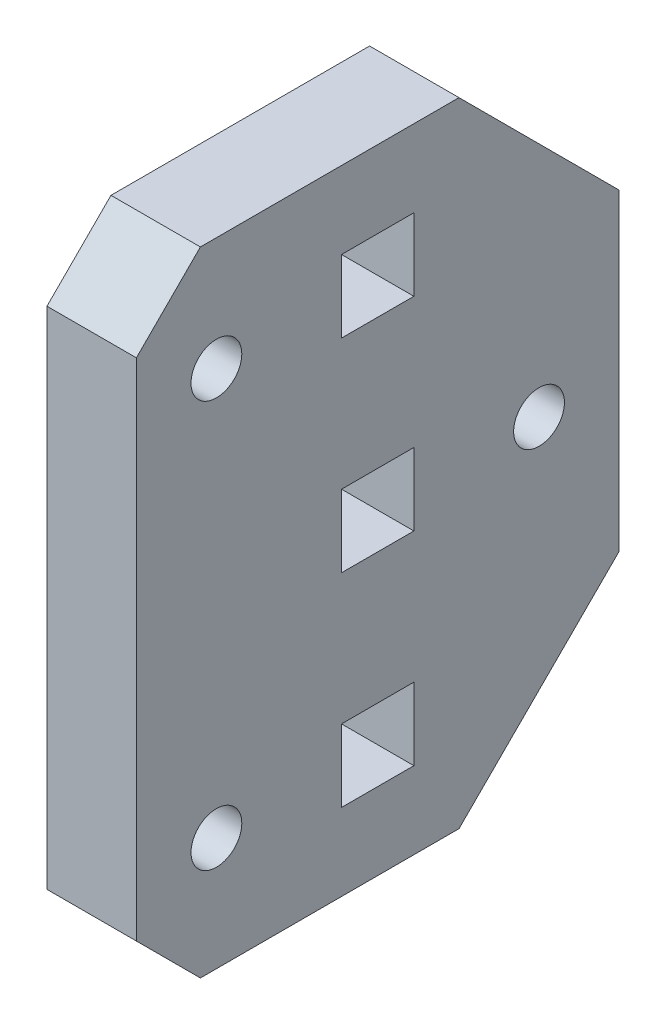
ISO-10303-21;
HEADER;
FILE_DESCRIPTION(('STEP AP214'),'2;1');
FILE_NAME('part.step','',(''),(''),'','','');
FILE_SCHEMA(('AUTOMOTIVE_DESIGN { 1 0 10303 214 1 1 1 1 }'));
ENDSEC;
DATA;
#1=APPLICATION_CONTEXT('core data for automotive mechanical design processes');
#2=APPLICATION_PROTOCOL_DEFINITION('international standard','automotive_design',2000,#1);
#3=PRODUCT_CONTEXT('',#1,'mechanical');
#4=PRODUCT('Part','Part','',(#3));
#5=PRODUCT_RELATED_PRODUCT_CATEGORY('part','',(#4));
#6=PRODUCT_DEFINITION_FORMATION('','',#4);
#7=PRODUCT_DEFINITION_CONTEXT('part definition',#1,'design');
#8=PRODUCT_DEFINITION('design','',#6,#7);
#9=PRODUCT_DEFINITION_SHAPE('','',#8);
#10=(LENGTH_UNIT() NAMED_UNIT(*) SI_UNIT(.MILLI.,.METRE.));
#11=(NAMED_UNIT(*) PLANE_ANGLE_UNIT() SI_UNIT($,.RADIAN.));
#12=(NAMED_UNIT(*) SI_UNIT($,.STERADIAN.) SOLID_ANGLE_UNIT());
#13=UNCERTAINTY_MEASURE_WITH_UNIT(LENGTH_MEASURE(1.E-05),#10,'distance_accuracy_value','');
#14=(GEOMETRIC_REPRESENTATION_CONTEXT(3) GLOBAL_UNCERTAINTY_ASSIGNED_CONTEXT((#13)) GLOBAL_UNIT_ASSIGNED_CONTEXT((#10,
#11,#12)) REPRESENTATION_CONTEXT('',''));
#15=CARTESIAN_POINT('',(0.,0.,0.));
#16=DIRECTION('',(0.,0.,1.));
#17=DIRECTION('',(1.,0.,0.));
#18=AXIS2_PLACEMENT_3D('',#15,#16,#17);
#19=CARTESIAN_POINT('',(5.588,0.,0.));
#20=DIRECTION('',(1.,0.,0.));
#21=DIRECTION('',(0.,0.,-1.));
#22=AXIS2_PLACEMENT_3D('',#19,#20,#21);
#23=PLANE('',#22);
#24=CARTESIAN_POINT('',(5.588,-12.6999951137207,10.0799951137272));
#25=DIRECTION('',(1.,0.,0.));
#26=DIRECTION('',(0.,0.,-1.));
#27=AXIS2_PLACEMENT_3D('',#24,#25,#26);
#28=CIRCLE('',#27,1.5875);
#29=CARTESIAN_POINT('',(5.588,-12.6999951137207,8.49249511372718));
#30=VERTEX_POINT('',#29);
#31=EDGE_CURVE('E593',#30,#30,#28,.T.);
#32=ORIENTED_EDGE('',*,*,#31,.F.);
#33=EDGE_LOOP('',(#32));
#34=FACE_BOUND('',#33,.T.);
#35=DIRECTION('',(0.,0.,-1.));
#36=VECTOR('',#35,1.);
#37=CARTESIAN_POINT('',(5.588,-14.9605902274463,2.26059022745141));
#38=LINE('',#37,#36);
#39=CARTESIAN_POINT('',(5.588,-14.9605902274463,2.26059022745141));
#40=VERTEX_POINT('',#39);
#41=CARTESIAN_POINT('',(5.588,-14.9605902274463,-2.26059999999982));
#42=VERTEX_POINT('',#41);
#43=EDGE_CURVE('E185',#40,#42,#38,.T.);
#44=ORIENTED_EDGE('',*,*,#43,.F.);
#45=DIRECTION('',(0.,-1.,0.));
#46=VECTOR('',#45,1.);
#47=CARTESIAN_POINT('',(5.588,-10.4393999999951,2.26059022745141));
#48=LINE('',#47,#46);
#49=CARTESIAN_POINT('',(5.588,-10.4393999999951,2.26059022745141));
#50=VERTEX_POINT('',#49);
#51=EDGE_CURVE('E175',#50,#40,#48,.T.);
#52=ORIENTED_EDGE('',*,*,#51,.F.);
#53=DIRECTION('',(0.,0.,1.));
#54=VECTOR('',#53,1.);
#55=CARTESIAN_POINT('',(5.588,-10.4393999999951,2.26059022745141));
#56=LINE('',#55,#54);
#57=CARTESIAN_POINT('',(5.588,-10.4393999999951,-2.26059999999982));
#58=VERTEX_POINT('',#57);
#59=EDGE_CURVE('E201',#58,#50,#56,.T.);
#60=ORIENTED_EDGE('',*,*,#59,.F.);
#61=DIRECTION('',(0.,1.,0.));
#62=VECTOR('',#61,1.);
#63=CARTESIAN_POINT('',(5.588,-10.4393999999951,-2.26059999999982));
#64=LINE('',#63,#62);
#65=EDGE_CURVE('E199',#42,#58,#64,.T.);
#66=ORIENTED_EDGE('',*,*,#65,.F.);
#67=EDGE_LOOP('',(#44,#52,#60,#66));
#68=FACE_BOUND('',#67,.T.);
#69=DIRECTION('',(0.,0.,-1.));
#70=VECTOR('',#69,1.);
#71=CARTESIAN_POINT('',(5.588,-2.26059511372562,2.26059511372562));
#72=LINE('',#71,#70);
#73=CARTESIAN_POINT('',(5.588,-2.26059511372562,2.26059511372562));
#74=VERTEX_POINT('',#73);
#75=CARTESIAN_POINT('',(5.588,-2.26059511372562,-2.26059511372562));
#76=VERTEX_POINT('',#75);
#77=EDGE_CURVE('E221',#74,#76,#72,.T.);
#78=ORIENTED_EDGE('',*,*,#77,.F.);
#79=DIRECTION('',(0.,-1.,0.));
#80=VECTOR('',#79,1.);
#81=CARTESIAN_POINT('',(5.588,2.26059511372562,2.26059511372562));
#82=LINE('',#81,#80);
#83=CARTESIAN_POINT('',(5.588,2.26059511372562,2.26059511372562));
#84=VERTEX_POINT('',#83);
#85=EDGE_CURVE('E219',#84,#74,#82,.T.);
#86=ORIENTED_EDGE('',*,*,#85,.F.);
#87=DIRECTION('',(0.,0.,1.));
#88=VECTOR('',#87,1.);
#89=CARTESIAN_POINT('',(5.588,2.26059511372562,2.26059511372562));
#90=LINE('',#89,#88);
#91=CARTESIAN_POINT('',(5.588,2.26059511372562,-2.26059511372562));
#92=VERTEX_POINT('',#91);
#93=EDGE_CURVE('E227',#92,#84,#90,.T.);
#94=ORIENTED_EDGE('',*,*,#93,.F.);
#95=DIRECTION('',(0.,1.,0.));
#96=VECTOR('',#95,1.);
#97=CARTESIAN_POINT('',(5.588,2.26059511372562,-2.26059511372562));
#98=LINE('',#97,#96);
#99=EDGE_CURVE('E224',#76,#92,#98,.T.);
#100=ORIENTED_EDGE('',*,*,#99,.F.);
#101=EDGE_LOOP('',(#78,#86,#94,#100));
#102=FACE_BOUND('',#101,.T.);
#103=DIRECTION('',(0.,0.,-1.));
#104=VECTOR('',#103,1.);
#105=CARTESIAN_POINT('',(5.588,10.4394097725486,2.26059022745141));
#106=LINE('',#105,#104);
#107=CARTESIAN_POINT('',(5.588,10.4394097725486,2.26059022745141));
#108=VERTEX_POINT('',#107);
#109=CARTESIAN_POINT('',(5.588,10.4394097725486,-2.26059999999982));
#110=VERTEX_POINT('',#109);
#111=EDGE_CURVE('E252',#108,#110,#106,.T.);
#112=ORIENTED_EDGE('',*,*,#111,.F.);
#113=DIRECTION('',(0.,-1.,0.));
#114=VECTOR('',#113,1.);
#115=CARTESIAN_POINT('',(5.588,14.9605999999998,2.26059022745142));
#116=LINE('',#115,#114);
#117=CARTESIAN_POINT('',(5.588,14.9605999999998,2.26059022745142));
#118=VERTEX_POINT('',#117);
#119=EDGE_CURVE('E250',#118,#108,#116,.T.);
#120=ORIENTED_EDGE('',*,*,#119,.F.);
#121=DIRECTION('',(0.,0.,1.));
#122=VECTOR('',#121,1.);
#123=CARTESIAN_POINT('',(5.588,14.9605999999998,2.26059022745142));
#124=LINE('',#123,#122);
#125=CARTESIAN_POINT('',(5.588,14.9605999999998,-2.26059999999982));
#126=VERTEX_POINT('',#125);
#127=EDGE_CURVE('E258',#126,#118,#124,.T.);
#128=ORIENTED_EDGE('',*,*,#127,.F.);
#129=DIRECTION('',(0.,1.,0.));
#130=VECTOR('',#129,1.);
#131=CARTESIAN_POINT('',(5.588,14.9605999999998,-2.26059999999982));
#132=LINE('',#131,#130);
#133=EDGE_CURVE('E255',#110,#126,#132,.T.);
#134=ORIENTED_EDGE('',*,*,#133,.F.);
#135=EDGE_LOOP('',(#112,#120,#128,#134));
#136=FACE_BOUND('',#135,.T.);
#137=DIRECTION('',(0.,-1.,0.));
#138=VECTOR('',#137,1.);
#139=CARTESIAN_POINT('',(5.588,19.7800048862752,15.0799951137272));
#140=LINE('',#139,#138);
#141=CARTESIAN_POINT('',(5.588,15.7800048862752,15.0799951137272));
#142=VERTEX_POINT('',#141);
#143=CARTESIAN_POINT('',(5.588,-15.779995113722,15.0799951137272));
#144=VERTEX_POINT('',#143);
#145=EDGE_CURVE('E281',#142,#144,#140,.T.);
#146=ORIENTED_EDGE('',*,*,#145,.T.);
#147=DIRECTION('',(0.,0.707106781186549,0.707106781186546));
#148=VECTOR('',#147,1.);
#149=CARTESIAN_POINT('',(5.588,-15.4299951137246,15.4299951137246));
#150=LINE('',#149,#148);
#151=CARTESIAN_POINT('',(5.588,-19.7799951137221,11.0799951137272));
#152=VERTEX_POINT('',#151);
#153=EDGE_CURVE('E43',#144,#152,#150,.F.);
#154=ORIENTED_EDGE('',*,*,#153,.T.);
#155=DIRECTION('',(0.,0.,-1.));
#156=VECTOR('',#155,1.);
#157=CARTESIAN_POINT('',(5.588,-19.7799951137221,15.0799951137272));
#158=LINE('',#157,#156);
#159=CARTESIAN_POINT('',(5.588,-19.7799951137221,-5.08000488627242));
#160=VERTEX_POINT('',#159);
#161=EDGE_CURVE('E283',#152,#160,#158,.T.);
#162=ORIENTED_EDGE('',*,*,#161,.T.);
#163=DIRECTION('',(0.,-0.707106781186546,0.707106781186549));
#164=VECTOR('',#163,1.);
#165=CARTESIAN_POINT('',(5.588,-12.4299999999973,-12.4299999999972));
#166=LINE('',#165,#164);
#167=CARTESIAN_POINT('',(5.588,-9.77999511372206,-15.0800048862724));
#168=VERTEX_POINT('',#167);
#169=EDGE_CURVE('E313',#160,#168,#166,.F.);
#170=ORIENTED_EDGE('',*,*,#169,.T.);
#171=DIRECTION('',(0.,1.,0.));
#172=VECTOR('',#171,1.);
#173=CARTESIAN_POINT('',(5.588,19.7800048862752,-15.0800048862724));
#174=LINE('',#173,#172);
#175=CARTESIAN_POINT('',(5.588,9.78000488627515,-15.0800048862724));
#176=VERTEX_POINT('',#175);
#177=EDGE_CURVE('E286',#168,#176,#174,.T.);
#178=ORIENTED_EDGE('',*,*,#177,.T.);
#179=DIRECTION('',(0.,-0.707106781186549,-0.707106781186546));
#180=VECTOR('',#179,1.);
#181=CARTESIAN_POINT('',(5.588,12.4300048862738,-12.4300048862738));
#182=LINE('',#181,#180);
#183=CARTESIAN_POINT('',(5.588,19.7800048862752,-5.08000488627243));
#184=VERTEX_POINT('',#183);
#185=EDGE_CURVE('E311',#176,#184,#182,.F.);
#186=ORIENTED_EDGE('',*,*,#185,.T.);
#187=DIRECTION('',(0.,0.,1.));
#188=VECTOR('',#187,1.);
#189=CARTESIAN_POINT('',(5.588,19.7800048862752,15.0799951137272));
#190=LINE('',#189,#188);
#191=CARTESIAN_POINT('',(5.588,19.7800048862752,11.0799951137272));
#192=VERTEX_POINT('',#191);
#193=EDGE_CURVE('E289',#184,#192,#190,.T.);
#194=ORIENTED_EDGE('',*,*,#193,.T.);
#195=DIRECTION('',(0.,0.707106781186547,-0.707106781186548));
#196=VECTOR('',#195,1.);
#197=CARTESIAN_POINT('',(5.588,15.4300000000012,15.4300000000012));
#198=LINE('',#197,#196);
#199=EDGE_CURVE('E329',#192,#142,#198,.F.);
#200=ORIENTED_EDGE('',*,*,#199,.T.);
#201=EDGE_LOOP('',(#146,#154,#162,#170,#178,#186,#194,#200));
#202=FACE_BOUND('',#201,.T.);
#203=CARTESIAN_POINT('',(5.588,12.7000048862742,10.0799951137272));
#204=DIRECTION('',(1.,0.,0.));
#205=DIRECTION('',(0.,0.,-1.));
#206=AXIS2_PLACEMENT_3D('',#203,#204,#205);
#207=CIRCLE('',#206,1.5875);
#208=CARTESIAN_POINT('',(5.588,12.7000048862742,8.49249511372718));
#209=VERTEX_POINT('',#208);
#210=EDGE_CURVE('E208',#209,#209,#207,.T.);
#211=ORIENTED_EDGE('',*,*,#210,.F.);
#212=EDGE_LOOP('',(#211));
#213=FACE_BOUND('',#212,.T.);
#214=CARTESIAN_POINT('',(5.588,0.,-10.0800048862724));
#215=DIRECTION('',(1.,0.,0.));
#216=DIRECTION('',(0.,0.,-1.));
#217=AXIS2_PLACEMENT_3D('',#214,#215,#216);
#218=CIRCLE('',#217,1.5875);
#219=CARTESIAN_POINT('',(5.588,0.,-11.6675048862724));
#220=VERTEX_POINT('',#219);
#221=EDGE_CURVE('E598',#220,#220,#218,.T.);
#222=ORIENTED_EDGE('',*,*,#221,.F.);
#223=EDGE_LOOP('',(#222));
#224=FACE_BOUND('',#223,.T.);
#225=ADVANCED_FACE('F35',(#34,#68,#102,#136,#202,#213,#224),#23,.T.);
#226=CARTESIAN_POINT('',(0.,0.,0.));
#227=DIRECTION('',(1.,0.,0.));
#228=DIRECTION('',(0.,0.,-1.));
#229=AXIS2_PLACEMENT_3D('',#226,#227,#228);
#230=PLANE('',#229);
#231=DIRECTION('',(0.,-1.,0.));
#232=VECTOR('',#231,1.);
#233=CARTESIAN_POINT('',(0.,2.26059511372562,2.26059511372562));
#234=LINE('',#233,#232);
#235=CARTESIAN_POINT('',(0.,2.26059511372562,2.26059511372562));
#236=VERTEX_POINT('',#235);
#237=CARTESIAN_POINT('',(0.,-2.26059511372562,2.26059511372562));
#238=VERTEX_POINT('',#237);
#239=EDGE_CURVE('E193',#236,#238,#234,.T.);
#240=ORIENTED_EDGE('',*,*,#239,.T.);
#241=DIRECTION('',(0.,0.,-1.));
#242=VECTOR('',#241,1.);
#243=CARTESIAN_POINT('',(0.,-2.26059511372562,2.26059511372562));
#244=LINE('',#243,#242);
#245=CARTESIAN_POINT('',(0.,-2.26059511372562,-2.26059511372562));
#246=VERTEX_POINT('',#245);
#247=EDGE_CURVE('E232',#238,#246,#244,.T.);
#248=ORIENTED_EDGE('',*,*,#247,.T.);
#249=DIRECTION('',(0.,1.,0.));
#250=VECTOR('',#249,1.);
#251=CARTESIAN_POINT('',(0.,2.26059511372562,-2.26059511372562));
#252=LINE('',#251,#250);
#253=CARTESIAN_POINT('',(0.,2.26059511372562,-2.26059511372562));
#254=VERTEX_POINT('',#253);
#255=EDGE_CURVE('E235',#246,#254,#252,.T.);
#256=ORIENTED_EDGE('',*,*,#255,.T.);
#257=DIRECTION('',(0.,0.,1.));
#258=VECTOR('',#257,1.);
#259=CARTESIAN_POINT('',(0.,2.26059511372562,2.26059511372562));
#260=LINE('',#259,#258);
#261=EDGE_CURVE('E222',#254,#236,#260,.T.);
#262=ORIENTED_EDGE('',*,*,#261,.T.);
#263=EDGE_LOOP('',(#240,#248,#256,#262));
#264=FACE_BOUND('',#263,.T.);
#265=DIRECTION('',(0.,0.,-1.));
#266=VECTOR('',#265,1.);
#267=CARTESIAN_POINT('',(0.,-19.7799951137221,15.0799951137272));
#268=LINE('',#267,#266);
#269=CARTESIAN_POINT('',(0.,-19.7799951137221,11.0799951137272));
#270=VERTEX_POINT('',#269);
#271=CARTESIAN_POINT('',(0.,-19.7799951137221,-5.08000488627242));
#272=VERTEX_POINT('',#271);
#273=EDGE_CURVE('E293',#270,#272,#268,.T.);
#274=ORIENTED_EDGE('',*,*,#273,.F.);
#275=DIRECTION('',(0.,-0.707106781186549,-0.707106781186546));
#276=VECTOR('',#275,1.);
#277=CARTESIAN_POINT('',(0.,-19.7799951137221,11.0799951137272));
#278=LINE('',#277,#276);
#279=CARTESIAN_POINT('',(0.,-15.779995113722,15.0799951137272));
#280=VERTEX_POINT('',#279);
#281=EDGE_CURVE('E323',#270,#280,#278,.F.);
#282=ORIENTED_EDGE('',*,*,#281,.T.);
#283=DIRECTION('',(0.,-1.,0.));
#284=VECTOR('',#283,1.);
#285=CARTESIAN_POINT('',(0.,19.7800048862752,15.0799951137272));
#286=LINE('',#285,#284);
#287=CARTESIAN_POINT('',(0.,15.7800048862752,15.0799951137272));
#288=VERTEX_POINT('',#287);
#289=EDGE_CURVE('E280',#288,#280,#286,.T.);
#290=ORIENTED_EDGE('',*,*,#289,.F.);
#291=DIRECTION('',(0.,-0.707106781186547,0.707106781186548));
#292=VECTOR('',#291,1.);
#293=CARTESIAN_POINT('',(0.,15.7800048862752,15.0799951137272));
#294=LINE('',#293,#292);
#295=CARTESIAN_POINT('',(0.,19.7800048862752,11.0799951137272));
#296=VERTEX_POINT('',#295);
#297=EDGE_CURVE('E321',#288,#296,#294,.F.);
#298=ORIENTED_EDGE('',*,*,#297,.T.);
#299=DIRECTION('',(0.,0.,1.));
#300=VECTOR('',#299,1.);
#301=CARTESIAN_POINT('',(0.,19.7800048862752,15.0799951137272));
#302=LINE('',#301,#300);
#303=CARTESIAN_POINT('',(0.,19.7800048862752,-5.08000488627243));
#304=VERTEX_POINT('',#303);
#305=EDGE_CURVE('E284',#304,#296,#302,.T.);
#306=ORIENTED_EDGE('',*,*,#305,.F.);
#307=DIRECTION('',(0.,0.707106781186549,0.707106781186546));
#308=VECTOR('',#307,1.);
#309=CARTESIAN_POINT('',(0.,19.7800048862752,-5.08000488627243));
#310=LINE('',#309,#308);
#311=CARTESIAN_POINT('',(0.,9.78000488627515,-15.0800048862724));
#312=VERTEX_POINT('',#311);
#313=EDGE_CURVE('E303',#304,#312,#310,.F.);
#314=ORIENTED_EDGE('',*,*,#313,.T.);
#315=DIRECTION('',(0.,1.,0.));
#316=VECTOR('',#315,1.);
#317=CARTESIAN_POINT('',(0.,19.7800048862752,-15.0800048862724));
#318=LINE('',#317,#316);
#319=CARTESIAN_POINT('',(0.,-9.77999511372206,-15.0800048862724));
#320=VERTEX_POINT('',#319);
#321=EDGE_CURVE('E295',#320,#312,#318,.T.);
#322=ORIENTED_EDGE('',*,*,#321,.F.);
#323=DIRECTION('',(0.,0.707106781186546,-0.707106781186549));
#324=VECTOR('',#323,1.);
#325=CARTESIAN_POINT('',(0.,-9.77999511372206,-15.0800048862724));
#326=LINE('',#325,#324);
#327=EDGE_CURVE('E305',#320,#272,#326,.F.);
#328=ORIENTED_EDGE('',*,*,#327,.T.);
#329=EDGE_LOOP('',(#274,#282,#290,#298,#306,#314,#322,#328));
#330=FACE_BOUND('',#329,.T.);
#331=DIRECTION('',(0.,-1.,0.));
#332=VECTOR('',#331,1.);
#333=CARTESIAN_POINT('',(0.,14.9605999999998,2.26059022745142));
#334=LINE('',#333,#332);
#335=CARTESIAN_POINT('',(0.,14.9605999999998,2.26059022745142));
#336=VERTEX_POINT('',#335);
#337=CARTESIAN_POINT('',(0.,10.4394097725486,2.26059022745141));
#338=VERTEX_POINT('',#337);
#339=EDGE_CURVE('E249',#336,#338,#334,.T.);
#340=ORIENTED_EDGE('',*,*,#339,.T.);
#341=DIRECTION('',(0.,0.,-1.));
#342=VECTOR('',#341,1.);
#343=CARTESIAN_POINT('',(0.,10.4394097725486,2.26059022745141));
#344=LINE('',#343,#342);
#345=CARTESIAN_POINT('',(0.,10.4394097725486,-2.26059999999982));
#346=VERTEX_POINT('',#345);
#347=EDGE_CURVE('E263',#338,#346,#344,.T.);
#348=ORIENTED_EDGE('',*,*,#347,.T.);
#349=DIRECTION('',(0.,1.,0.));
#350=VECTOR('',#349,1.);
#351=CARTESIAN_POINT('',(0.,14.9605999999998,-2.26059999999982));
#352=LINE('',#351,#350);
#353=CARTESIAN_POINT('',(0.,14.9605999999998,-2.26059999999982));
#354=VERTEX_POINT('',#353);
#355=EDGE_CURVE('E266',#346,#354,#352,.T.);
#356=ORIENTED_EDGE('',*,*,#355,.T.);
#357=DIRECTION('',(0.,0.,1.));
#358=VECTOR('',#357,1.);
#359=CARTESIAN_POINT('',(0.,14.9605999999998,2.26059022745142));
#360=LINE('',#359,#358);
#361=EDGE_CURVE('E253',#354,#336,#360,.T.);
#362=ORIENTED_EDGE('',*,*,#361,.T.);
#363=EDGE_LOOP('',(#340,#348,#356,#362));
#364=FACE_BOUND('',#363,.T.);
#365=DIRECTION('',(0.,-1.,0.));
#366=VECTOR('',#365,1.);
#367=CARTESIAN_POINT('',(0.,-10.4393999999951,2.26059022745141));
#368=LINE('',#367,#366);
#369=CARTESIAN_POINT('',(0.,-10.4393999999951,2.26059022745141));
#370=VERTEX_POINT('',#369);
#371=CARTESIAN_POINT('',(0.,-14.9605902274463,2.26059022745141));
#372=VERTEX_POINT('',#371);
#373=EDGE_CURVE('E206',#370,#372,#368,.T.);
#374=ORIENTED_EDGE('',*,*,#373,.T.);
#375=DIRECTION('',(0.,0.,-1.));
#376=VECTOR('',#375,1.);
#377=CARTESIAN_POINT('',(0.,-14.9605902274463,2.26059022745141));
#378=LINE('',#377,#376);
#379=CARTESIAN_POINT('',(0.,-14.9605902274463,-2.26059999999982));
#380=VERTEX_POINT('',#379);
#381=EDGE_CURVE('E192',#372,#380,#378,.T.);
#382=ORIENTED_EDGE('',*,*,#381,.T.);
#383=DIRECTION('',(0.,1.,0.));
#384=VECTOR('',#383,1.);
#385=CARTESIAN_POINT('',(0.,-10.4393999999951,-2.26059999999982));
#386=LINE('',#385,#384);
#387=CARTESIAN_POINT('',(0.,-10.4393999999951,-2.26059999999982));
#388=VERTEX_POINT('',#387);
#389=EDGE_CURVE('E210',#380,#388,#386,.T.);
#390=ORIENTED_EDGE('',*,*,#389,.T.);
#391=DIRECTION('',(0.,0.,1.));
#392=VECTOR('',#391,1.);
#393=CARTESIAN_POINT('',(0.,-10.4393999999951,2.26059022745141));
#394=LINE('',#393,#392);
#395=EDGE_CURVE('E186',#388,#370,#394,.T.);
#396=ORIENTED_EDGE('',*,*,#395,.T.);
#397=EDGE_LOOP('',(#374,#382,#390,#396));
#398=FACE_BOUND('',#397,.T.);
#399=CARTESIAN_POINT('',(0.,12.7000048862742,10.0799951137272));
#400=DIRECTION('',(1.,0.,0.));
#401=DIRECTION('',(0.,0.,-1.));
#402=AXIS2_PLACEMENT_3D('',#399,#400,#401);
#403=CIRCLE('',#402,1.5875);
#404=CARTESIAN_POINT('',(0.,12.7000048862742,8.49249511372718));
#405=VERTEX_POINT('',#404);
#406=EDGE_CURVE('E600',#405,#405,#403,.T.);
#407=ORIENTED_EDGE('',*,*,#406,.T.);
#408=EDGE_LOOP('',(#407));
#409=FACE_BOUND('',#408,.T.);
#410=CARTESIAN_POINT('',(0.,-12.6999951137207,10.0799951137272));
#411=DIRECTION('',(1.,0.,0.));
#412=DIRECTION('',(0.,0.,-1.));
#413=AXIS2_PLACEMENT_3D('',#410,#411,#412);
#414=CIRCLE('',#413,1.5875);
#415=CARTESIAN_POINT('',(0.,-12.6999951137207,8.49249511372718));
#416=VERTEX_POINT('',#415);
#417=EDGE_CURVE('E596',#416,#416,#414,.T.);
#418=ORIENTED_EDGE('',*,*,#417,.T.);
#419=EDGE_LOOP('',(#418));
#420=FACE_BOUND('',#419,.T.);
#421=CARTESIAN_POINT('',(0.,0.,-10.0800048862724));
#422=DIRECTION('',(1.,0.,0.));
#423=DIRECTION('',(0.,0.,-1.));
#424=AXIS2_PLACEMENT_3D('',#421,#422,#423);
#425=CIRCLE('',#424,1.5875);
#426=CARTESIAN_POINT('',(0.,0.,-11.6675048862724));
#427=VERTEX_POINT('',#426);
#428=EDGE_CURVE('E603',#427,#427,#425,.T.);
#429=ORIENTED_EDGE('',*,*,#428,.T.);
#430=EDGE_LOOP('',(#429));
#431=FACE_BOUND('',#430,.T.);
#432=ADVANCED_FACE('F344',(#264,#330,#364,#398,#409,#420,#431),#230,.F.);
#433=CARTESIAN_POINT('',(5.588,19.7800048862752,15.0799951137272));
#434=DIRECTION('',(0.,0.,-1.));
#435=DIRECTION('',(0.,1.,0.));
#436=AXIS2_PLACEMENT_3D('',#433,#434,#435);
#437=PLANE('',#436);
#438=ORIENTED_EDGE('',*,*,#289,.T.);
#439=DIRECTION('',(1.,0.,0.));
#440=VECTOR('',#439,1.);
#441=CARTESIAN_POINT('',(5.588,-15.779995113722,15.0799951137272));
#442=LINE('',#441,#440);
#443=EDGE_CURVE('E56',#280,#144,#442,.T.);
#444=ORIENTED_EDGE('',*,*,#443,.T.);
#445=ORIENTED_EDGE('',*,*,#145,.F.);
#446=DIRECTION('',(-1.,0.,0.));
#447=VECTOR('',#446,1.);
#448=CARTESIAN_POINT('',(5.588,15.7800048862752,15.0799951137272));
#449=LINE('',#448,#447);
#450=EDGE_CURVE('E325',#142,#288,#449,.T.);
#451=ORIENTED_EDGE('',*,*,#450,.T.);
#452=EDGE_LOOP('',(#438,#444,#445,#451));
#453=FACE_BOUND('',#452,.T.);
#454=ADVANCED_FACE('F346',(#453),#437,.F.);
#455=CARTESIAN_POINT('',(5.588,-19.7799951137221,15.0799951137272));
#456=DIRECTION('',(0.,1.,0.));
#457=DIRECTION('',(0.,0.,1.));
#458=AXIS2_PLACEMENT_3D('',#455,#456,#457);
#459=PLANE('',#458);
#460=ORIENTED_EDGE('',*,*,#161,.F.);
#461=DIRECTION('',(-1.,0.,0.));
#462=VECTOR('',#461,1.);
#463=CARTESIAN_POINT('',(5.588,-19.7799951137221,11.0799951137272));
#464=LINE('',#463,#462);
#465=EDGE_CURVE('E318',#152,#270,#464,.T.);
#466=ORIENTED_EDGE('',*,*,#465,.T.);
#467=ORIENTED_EDGE('',*,*,#273,.T.);
#468=DIRECTION('',(1.,0.,0.));
#469=VECTOR('',#468,1.);
#470=CARTESIAN_POINT('',(5.588,-19.7799951137221,-5.08000488627242));
#471=LINE('',#470,#469);
#472=EDGE_CURVE('E308',#272,#160,#471,.T.);
#473=ORIENTED_EDGE('',*,*,#472,.T.);
#474=EDGE_LOOP('',(#460,#466,#467,#473));
#475=FACE_BOUND('',#474,.T.);
#476=ADVANCED_FACE('F337',(#475),#459,.F.);
#477=CARTESIAN_POINT('',(5.588,19.7800048862752,-15.0800048862724));
#478=DIRECTION('',(0.,0.,1.));
#479=DIRECTION('',(0.,-1.,0.));
#480=AXIS2_PLACEMENT_3D('',#477,#478,#479);
#481=PLANE('',#480);
#482=ORIENTED_EDGE('',*,*,#177,.F.);
#483=DIRECTION('',(-1.,0.,0.));
#484=VECTOR('',#483,1.);
#485=CARTESIAN_POINT('',(5.588,-9.77999511372206,-15.0800048862724));
#486=LINE('',#485,#484);
#487=EDGE_CURVE('E300',#168,#320,#486,.T.);
#488=ORIENTED_EDGE('',*,*,#487,.T.);
#489=ORIENTED_EDGE('',*,*,#321,.T.);
#490=DIRECTION('',(1.,0.,0.));
#491=VECTOR('',#490,1.);
#492=CARTESIAN_POINT('',(5.588,9.78000488627515,-15.0800048862724));
#493=LINE('',#492,#491);
#494=EDGE_CURVE('E291',#312,#176,#493,.T.);
#495=ORIENTED_EDGE('',*,*,#494,.T.);
#496=EDGE_LOOP('',(#482,#488,#489,#495));
#497=FACE_BOUND('',#496,.T.);
#498=ADVANCED_FACE('F360',(#497),#481,.F.);
#499=CARTESIAN_POINT('',(5.588,19.7800048862752,15.0799951137272));
#500=DIRECTION('',(0.,-1.,0.));
#501=DIRECTION('',(0.,0.,-1.));
#502=AXIS2_PLACEMENT_3D('',#499,#500,#501);
#503=PLANE('',#502);
#504=ORIENTED_EDGE('',*,*,#305,.T.);
#505=DIRECTION('',(1.,0.,0.));
#506=VECTOR('',#505,1.);
#507=CARTESIAN_POINT('',(5.588,19.7800048862752,11.0799951137272));
#508=LINE('',#507,#506);
#509=EDGE_CURVE('E11',#296,#192,#508,.T.);
#510=ORIENTED_EDGE('',*,*,#509,.T.);
#511=ORIENTED_EDGE('',*,*,#193,.F.);
#512=DIRECTION('',(-1.,0.,0.));
#513=VECTOR('',#512,1.);
#514=CARTESIAN_POINT('',(5.588,19.7800048862752,-5.08000488627243));
#515=LINE('',#514,#513);
#516=EDGE_CURVE('E315',#184,#304,#515,.T.);
#517=ORIENTED_EDGE('',*,*,#516,.T.);
#518=EDGE_LOOP('',(#504,#510,#511,#517));
#519=FACE_BOUND('',#518,.T.);
#520=ADVANCED_FACE('F351',(#519),#503,.F.);
#521=CARTESIAN_POINT('',(5.588,14.9605999999998,2.26059022745142));
#522=DIRECTION('',(0.,0.,-1.));
#523=DIRECTION('',(0.,1.,0.));
#524=AXIS2_PLACEMENT_3D('',#521,#522,#523);
#525=PLANE('',#524);
#526=ORIENTED_EDGE('',*,*,#339,.F.);
#527=DIRECTION('',(-1.,0.,0.));
#528=VECTOR('',#527,1.);
#529=CARTESIAN_POINT('',(5.588,14.9605999999998,2.26059022745142));
#530=LINE('',#529,#528);
#531=EDGE_CURVE('E260',#118,#336,#530,.T.);
#532=ORIENTED_EDGE('',*,*,#531,.F.);
#533=ORIENTED_EDGE('',*,*,#119,.T.);
#534=DIRECTION('',(-1.,0.,0.));
#535=VECTOR('',#534,1.);
#536=CARTESIAN_POINT('',(5.588,10.4394097725486,2.26059022745141));
#537=LINE('',#536,#535);
#538=EDGE_CURVE('E277',#108,#338,#537,.T.);
#539=ORIENTED_EDGE('',*,*,#538,.T.);
#540=EDGE_LOOP('',(#526,#532,#533,#539));
#541=FACE_BOUND('',#540,.T.);
#542=ADVANCED_FACE('F386',(#541),#525,.T.);
#543=CARTESIAN_POINT('',(5.588,10.4394097725486,2.26059022745141));
#544=DIRECTION('',(0.,1.,0.));
#545=DIRECTION('',(0.,0.,1.));
#546=AXIS2_PLACEMENT_3D('',#543,#544,#545);
#547=PLANE('',#546);
#548=ORIENTED_EDGE('',*,*,#347,.F.);
#549=ORIENTED_EDGE('',*,*,#538,.F.);
#550=ORIENTED_EDGE('',*,*,#111,.T.);
#551=DIRECTION('',(-1.,0.,0.));
#552=VECTOR('',#551,1.);
#553=CARTESIAN_POINT('',(5.588,10.4394097725486,-2.26059999999982));
#554=LINE('',#553,#552);
#555=EDGE_CURVE('E275',#110,#346,#554,.T.);
#556=ORIENTED_EDGE('',*,*,#555,.T.);
#557=EDGE_LOOP('',(#548,#549,#550,#556));
#558=FACE_BOUND('',#557,.T.);
#559=ADVANCED_FACE('F419',(#558),#547,.T.);
#560=CARTESIAN_POINT('',(5.588,14.9605999999998,-2.26059999999982));
#561=DIRECTION('',(0.,0.,1.));
#562=DIRECTION('',(1.,0.,0.));
#563=AXIS2_PLACEMENT_3D('',#560,#561,#562);
#564=PLANE('',#563);
#565=ORIENTED_EDGE('',*,*,#355,.F.);
#566=ORIENTED_EDGE('',*,*,#555,.F.);
#567=ORIENTED_EDGE('',*,*,#133,.T.);
#568=DIRECTION('',(-1.,0.,0.));
#569=VECTOR('',#568,1.);
#570=CARTESIAN_POINT('',(5.588,14.9605999999998,-2.26059999999982));
#571=LINE('',#570,#569);
#572=EDGE_CURVE('E273',#126,#354,#571,.T.);
#573=ORIENTED_EDGE('',*,*,#572,.T.);
#574=EDGE_LOOP('',(#565,#566,#567,#573));
#575=FACE_BOUND('',#574,.T.);
#576=ADVANCED_FACE('F426',(#575),#564,.T.);
#577=CARTESIAN_POINT('',(5.588,14.9605999999998,2.26059022745142));
#578=DIRECTION('',(0.,-1.,0.));
#579=DIRECTION('',(0.,0.,-1.));
#580=AXIS2_PLACEMENT_3D('',#577,#578,#579);
#581=PLANE('',#580);
#582=ORIENTED_EDGE('',*,*,#361,.F.);
#583=ORIENTED_EDGE('',*,*,#572,.F.);
#584=ORIENTED_EDGE('',*,*,#127,.T.);
#585=ORIENTED_EDGE('',*,*,#531,.T.);
#586=EDGE_LOOP('',(#582,#583,#584,#585));
#587=FACE_BOUND('',#586,.T.);
#588=ADVANCED_FACE('F433',(#587),#581,.T.);
#589=CARTESIAN_POINT('',(5.588,2.26059511372562,2.26059511372562));
#590=DIRECTION('',(0.,0.,-1.));
#591=DIRECTION('',(0.,1.,0.));
#592=AXIS2_PLACEMENT_3D('',#589,#590,#591);
#593=PLANE('',#592);
#594=ORIENTED_EDGE('',*,*,#239,.F.);
#595=DIRECTION('',(-1.,0.,0.));
#596=VECTOR('',#595,1.);
#597=CARTESIAN_POINT('',(5.588,2.26059511372562,2.26059511372562));
#598=LINE('',#597,#596);
#599=EDGE_CURVE('E229',#84,#236,#598,.T.);
#600=ORIENTED_EDGE('',*,*,#599,.F.);
#601=ORIENTED_EDGE('',*,*,#85,.T.);
#602=DIRECTION('',(-1.,0.,0.));
#603=VECTOR('',#602,1.);
#604=CARTESIAN_POINT('',(5.588,-2.26059511372562,2.26059511372562));
#605=LINE('',#604,#603);
#606=EDGE_CURVE('E246',#74,#238,#605,.T.);
#607=ORIENTED_EDGE('',*,*,#606,.T.);
#608=EDGE_LOOP('',(#594,#600,#601,#607));
#609=FACE_BOUND('',#608,.T.);
#610=ADVANCED_FACE('F441',(#609),#593,.T.);
#611=CARTESIAN_POINT('',(5.588,-2.26059511372562,2.26059511372562));
#612=DIRECTION('',(0.,1.,0.));
#613=DIRECTION('',(0.,0.,1.));
#614=AXIS2_PLACEMENT_3D('',#611,#612,#613);
#615=PLANE('',#614);
#616=ORIENTED_EDGE('',*,*,#247,.F.);
#617=ORIENTED_EDGE('',*,*,#606,.F.);
#618=ORIENTED_EDGE('',*,*,#77,.T.);
#619=DIRECTION('',(-1.,0.,0.));
#620=VECTOR('',#619,1.);
#621=CARTESIAN_POINT('',(5.588,-2.26059511372562,-2.26059511372562));
#622=LINE('',#621,#620);
#623=EDGE_CURVE('E244',#76,#246,#622,.T.);
#624=ORIENTED_EDGE('',*,*,#623,.T.);
#625=EDGE_LOOP('',(#616,#617,#618,#624));
#626=FACE_BOUND('',#625,.T.);
#627=ADVANCED_FACE('F449',(#626),#615,.T.);
#628=CARTESIAN_POINT('',(5.588,2.26059511372562,-2.26059511372562));
#629=DIRECTION('',(0.,0.,1.));
#630=DIRECTION('',(0.,-1.,0.));
#631=AXIS2_PLACEMENT_3D('',#628,#629,#630);
#632=PLANE('',#631);
#633=ORIENTED_EDGE('',*,*,#255,.F.);
#634=ORIENTED_EDGE('',*,*,#623,.F.);
#635=ORIENTED_EDGE('',*,*,#99,.T.);
#636=DIRECTION('',(-1.,0.,0.));
#637=VECTOR('',#636,1.);
#638=CARTESIAN_POINT('',(5.588,2.26059511372562,-2.26059511372562));
#639=LINE('',#638,#637);
#640=EDGE_CURVE('E242',#92,#254,#639,.T.);
#641=ORIENTED_EDGE('',*,*,#640,.T.);
#642=EDGE_LOOP('',(#633,#634,#635,#641));
#643=FACE_BOUND('',#642,.T.);
#644=ADVANCED_FACE('F457',(#643),#632,.T.);
#645=CARTESIAN_POINT('',(5.588,2.26059511372562,2.26059511372562));
#646=DIRECTION('',(0.,-1.,0.));
#647=DIRECTION('',(0.,0.,-1.));
#648=AXIS2_PLACEMENT_3D('',#645,#646,#647);
#649=PLANE('',#648);
#650=ORIENTED_EDGE('',*,*,#261,.F.);
#651=ORIENTED_EDGE('',*,*,#640,.F.);
#652=ORIENTED_EDGE('',*,*,#93,.T.);
#653=ORIENTED_EDGE('',*,*,#599,.T.);
#654=EDGE_LOOP('',(#650,#651,#652,#653));
#655=FACE_BOUND('',#654,.T.);
#656=ADVANCED_FACE('F465',(#655),#649,.T.);
#657=CARTESIAN_POINT('',(5.588,-10.4393999999951,2.26059022745141));
#658=DIRECTION('',(0.,0.,-1.));
#659=DIRECTION('',(0.,1.,0.));
#660=AXIS2_PLACEMENT_3D('',#657,#658,#659);
#661=PLANE('',#660);
#662=ORIENTED_EDGE('',*,*,#373,.F.);
#663=DIRECTION('',(-1.,0.,0.));
#664=VECTOR('',#663,1.);
#665=CARTESIAN_POINT('',(5.588,-10.4393999999951,2.26059022745141));
#666=LINE('',#665,#664);
#667=EDGE_CURVE('E181',#50,#370,#666,.T.);
#668=ORIENTED_EDGE('',*,*,#667,.F.);
#669=ORIENTED_EDGE('',*,*,#51,.T.);
#670=DIRECTION('',(-1.,0.,0.));
#671=VECTOR('',#670,1.);
#672=CARTESIAN_POINT('',(5.588,-14.9605902274463,2.26059022745141));
#673=LINE('',#672,#671);
#674=EDGE_CURVE('E178',#40,#372,#673,.T.);
#675=ORIENTED_EDGE('',*,*,#674,.T.);
#676=EDGE_LOOP('',(#662,#668,#669,#675));
#677=FACE_BOUND('',#676,.T.);
#678=ADVANCED_FACE('F177',(#677),#661,.T.);
#679=CARTESIAN_POINT('',(5.588,-14.9605902274463,2.26059022745141));
#680=DIRECTION('',(0.,1.,0.));
#681=DIRECTION('',(0.,0.,1.));
#682=AXIS2_PLACEMENT_3D('',#679,#680,#681);
#683=PLANE('',#682);
#684=ORIENTED_EDGE('',*,*,#381,.F.);
#685=ORIENTED_EDGE('',*,*,#674,.F.);
#686=ORIENTED_EDGE('',*,*,#43,.T.);
#687=DIRECTION('',(-1.,0.,0.));
#688=VECTOR('',#687,1.);
#689=CARTESIAN_POINT('',(5.588,-14.9605902274463,-2.26059999999982));
#690=LINE('',#689,#688);
#691=EDGE_CURVE('E194',#42,#380,#690,.T.);
#692=ORIENTED_EDGE('',*,*,#691,.T.);
#693=EDGE_LOOP('',(#684,#685,#686,#692));
#694=FACE_BOUND('',#693,.T.);
#695=ADVANCED_FACE('F189',(#694),#683,.T.);
#696=CARTESIAN_POINT('',(5.588,-10.4393999999951,-2.26059999999982));
#697=DIRECTION('',(0.,0.,1.));
#698=DIRECTION('',(0.,-1.,0.));
#699=AXIS2_PLACEMENT_3D('',#696,#697,#698);
#700=PLANE('',#699);
#701=ORIENTED_EDGE('',*,*,#389,.F.);
#702=ORIENTED_EDGE('',*,*,#691,.F.);
#703=ORIENTED_EDGE('',*,*,#65,.T.);
#704=DIRECTION('',(-1.,0.,0.));
#705=VECTOR('',#704,1.);
#706=CARTESIAN_POINT('',(5.588,-10.4393999999951,-2.26059999999982));
#707=LINE('',#706,#705);
#708=EDGE_CURVE('E216',#58,#388,#707,.T.);
#709=ORIENTED_EDGE('',*,*,#708,.T.);
#710=EDGE_LOOP('',(#701,#702,#703,#709));
#711=FACE_BOUND('',#710,.T.);
#712=ADVANCED_FACE('F486',(#711),#700,.T.);
#713=CARTESIAN_POINT('',(5.588,-10.4393999999951,2.26059022745141));
#714=DIRECTION('',(0.,-1.,0.));
#715=DIRECTION('',(0.,0.,-1.));
#716=AXIS2_PLACEMENT_3D('',#713,#714,#715);
#717=PLANE('',#716);
#718=ORIENTED_EDGE('',*,*,#395,.F.);
#719=ORIENTED_EDGE('',*,*,#708,.F.);
#720=ORIENTED_EDGE('',*,*,#59,.T.);
#721=ORIENTED_EDGE('',*,*,#667,.T.);
#722=EDGE_LOOP('',(#718,#719,#720,#721));
#723=FACE_BOUND('',#722,.T.);
#724=ADVANCED_FACE('F493',(#723),#717,.T.);
#725=CARTESIAN_POINT('',(5.588,12.7000048862742,10.0799951137272));
#726=DIRECTION('',(-1.,0.,0.));
#727=DIRECTION('',(0.,0.,1.));
#728=AXIS2_PLACEMENT_3D('',#725,#726,#727);
#729=CYLINDRICAL_SURFACE('',#728,1.5875);
#730=ORIENTED_EDGE('',*,*,#210,.T.);
#731=EDGE_LOOP('',(#730));
#732=FACE_BOUND('',#731,.T.);
#733=ORIENTED_EDGE('',*,*,#406,.F.);
#734=EDGE_LOOP('',(#733));
#735=FACE_BOUND('',#734,.T.);
#736=ADVANCED_FACE('F501',(#732,#735),#729,.F.);
#737=CARTESIAN_POINT('',(5.588,-12.6999951137207,10.0799951137272));
#738=DIRECTION('',(-1.,0.,0.));
#739=DIRECTION('',(0.,0.,1.));
#740=AXIS2_PLACEMENT_3D('',#737,#738,#739);
#741=CYLINDRICAL_SURFACE('',#740,1.5875);
#742=ORIENTED_EDGE('',*,*,#31,.T.);
#743=EDGE_LOOP('',(#742));
#744=FACE_BOUND('',#743,.T.);
#745=ORIENTED_EDGE('',*,*,#417,.F.);
#746=EDGE_LOOP('',(#745));
#747=FACE_BOUND('',#746,.T.);
#748=ADVANCED_FACE('F372',(#744,#747),#741,.F.);
#749=CARTESIAN_POINT('',(5.588,0.,-10.0800048862724));
#750=DIRECTION('',(-1.,0.,0.));
#751=DIRECTION('',(0.,0.,1.));
#752=AXIS2_PLACEMENT_3D('',#749,#750,#751);
#753=CYLINDRICAL_SURFACE('',#752,1.5875);
#754=ORIENTED_EDGE('',*,*,#221,.T.);
#755=EDGE_LOOP('',(#754));
#756=FACE_BOUND('',#755,.T.);
#757=ORIENTED_EDGE('',*,*,#428,.F.);
#758=EDGE_LOOP('',(#757));
#759=FACE_BOUND('',#758,.T.);
#760=ADVANCED_FACE('F365',(#756,#759),#753,.F.);
#761=CARTESIAN_POINT('',(5.588,-9.77999511372206,-15.0800048862724));
#762=DIRECTION('',(0.,0.707106781186549,0.707106781186546));
#763=DIRECTION('',(-1.,0.,0.));
#764=AXIS2_PLACEMENT_3D('',#761,#762,#763);
#765=PLANE('',#764);
#766=ORIENTED_EDGE('',*,*,#169,.F.);
#767=ORIENTED_EDGE('',*,*,#472,.F.);
#768=ORIENTED_EDGE('',*,*,#327,.F.);
#769=ORIENTED_EDGE('',*,*,#487,.F.);
#770=EDGE_LOOP('',(#766,#767,#768,#769));
#771=FACE_BOUND('',#770,.T.);
#772=ADVANCED_FACE('F363',(#771),#765,.F.);
#773=CARTESIAN_POINT('',(5.588,19.7800048862752,-5.08000488627243));
#774=DIRECTION('',(0.,-0.707106781186546,0.707106781186549));
#775=DIRECTION('',(-1.,0.,0.));
#776=AXIS2_PLACEMENT_3D('',#773,#774,#775);
#777=PLANE('',#776);
#778=ORIENTED_EDGE('',*,*,#185,.F.);
#779=ORIENTED_EDGE('',*,*,#494,.F.);
#780=ORIENTED_EDGE('',*,*,#313,.F.);
#781=ORIENTED_EDGE('',*,*,#516,.F.);
#782=EDGE_LOOP('',(#778,#779,#780,#781));
#783=FACE_BOUND('',#782,.T.);
#784=ADVANCED_FACE('F355',(#783),#777,.F.);
#785=CARTESIAN_POINT('',(5.588,-19.7799951137221,11.0799951137272));
#786=DIRECTION('',(0.,0.707106781186546,-0.707106781186549));
#787=DIRECTION('',(-1.,0.,0.));
#788=AXIS2_PLACEMENT_3D('',#785,#786,#787);
#789=PLANE('',#788);
#790=ORIENTED_EDGE('',*,*,#153,.F.);
#791=ORIENTED_EDGE('',*,*,#443,.F.);
#792=ORIENTED_EDGE('',*,*,#281,.F.);
#793=ORIENTED_EDGE('',*,*,#465,.F.);
#794=EDGE_LOOP('',(#790,#791,#792,#793));
#795=FACE_BOUND('',#794,.T.);
#796=ADVANCED_FACE('F341',(#795),#789,.F.);
#797=CARTESIAN_POINT('',(5.588,15.7800048862752,15.0799951137272));
#798=DIRECTION('',(0.,-0.707106781186548,-0.707106781186547));
#799=DIRECTION('',(-1.,0.,0.));
#800=AXIS2_PLACEMENT_3D('',#797,#798,#799);
#801=PLANE('',#800);
#802=ORIENTED_EDGE('',*,*,#199,.F.);
#803=ORIENTED_EDGE('',*,*,#509,.F.);
#804=ORIENTED_EDGE('',*,*,#297,.F.);
#805=ORIENTED_EDGE('',*,*,#450,.F.);
#806=EDGE_LOOP('',(#802,#803,#804,#805));
#807=FACE_BOUND('',#806,.T.);
#808=ADVANCED_FACE('F37',(#807),#801,.F.);
#809=CLOSED_SHELL('',(#225,#432,#454,#476,#498,#520,#542,#559,#576,#588,#610,#627,#644,#656,
#678,#695,#712,#724,#736,#748,#760,#772,#784,#796,#808));
#810=MANIFOLD_SOLID_BREP('B2',#809);
#811=ADVANCED_BREP_SHAPE_REPRESENTATION('',(#18,#810),#14);
#812=SHAPE_DEFINITION_REPRESENTATION(#9,#811);
ENDSEC;
END-ISO-10303-21;
